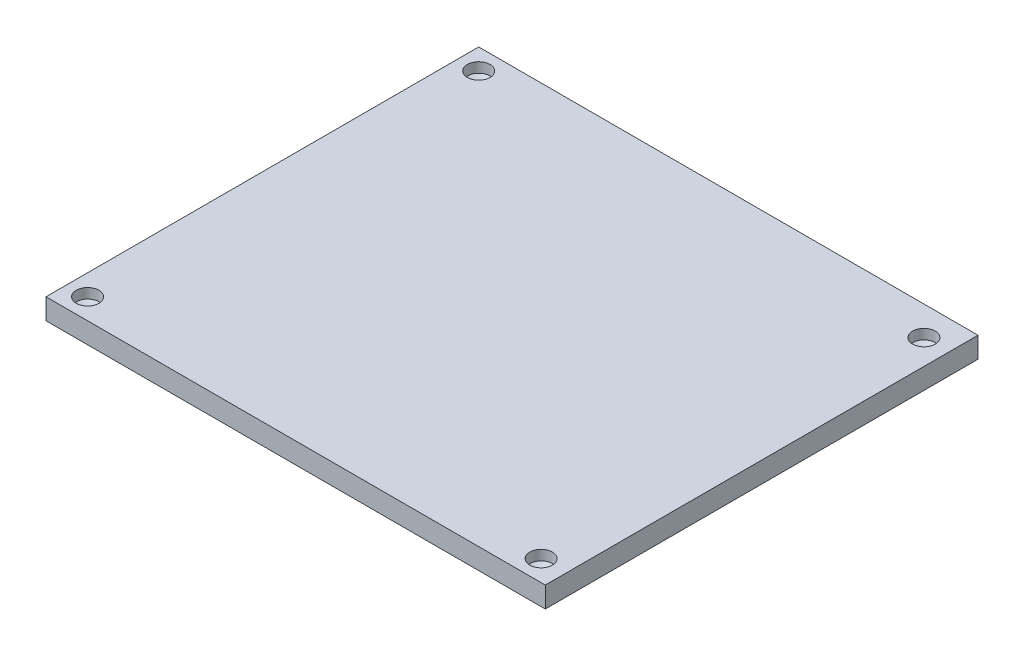
ISO-10303-21;
HEADER;
FILE_DESCRIPTION(('STEP AP214'),'2;1');
FILE_NAME('part.step','',(''),(''),'','','');
FILE_SCHEMA(('AUTOMOTIVE_DESIGN { 1 0 10303 214 1 1 1 1 }'));
ENDSEC;
DATA;
#1=APPLICATION_CONTEXT('core data for automotive mechanical design processes');
#2=APPLICATION_PROTOCOL_DEFINITION('international standard','automotive_design',2000,#1);
#3=PRODUCT_CONTEXT('',#1,'mechanical');
#4=PRODUCT('Part','Part','',(#3));
#5=PRODUCT_RELATED_PRODUCT_CATEGORY('part','',(#4));
#6=PRODUCT_DEFINITION_FORMATION('','',#4);
#7=PRODUCT_DEFINITION_CONTEXT('part definition',#1,'design');
#8=PRODUCT_DEFINITION('design','',#6,#7);
#9=PRODUCT_DEFINITION_SHAPE('','',#8);
#10=(LENGTH_UNIT() NAMED_UNIT(*) SI_UNIT(.MILLI.,.METRE.));
#11=(NAMED_UNIT(*) PLANE_ANGLE_UNIT() SI_UNIT($,.RADIAN.));
#12=(NAMED_UNIT(*) SI_UNIT($,.STERADIAN.) SOLID_ANGLE_UNIT());
#13=UNCERTAINTY_MEASURE_WITH_UNIT(LENGTH_MEASURE(1.E-05),#10,'distance_accuracy_value','');
#14=(GEOMETRIC_REPRESENTATION_CONTEXT(3) GLOBAL_UNCERTAINTY_ASSIGNED_CONTEXT((#13)) GLOBAL_UNIT_ASSIGNED_CONTEXT((#10,
#11,#12)) REPRESENTATION_CONTEXT('',''));
#15=CARTESIAN_POINT('',(0.,0.,0.));
#16=DIRECTION('',(0.,0.,1.));
#17=DIRECTION('',(1.,0.,0.));
#18=AXIS2_PLACEMENT_3D('',#15,#16,#17);
#19=CARTESIAN_POINT('',(-38.1,3.175,33.02));
#20=DIRECTION('',(0.,0.,-1.));
#21=DIRECTION('',(-1.,0.,0.));
#22=AXIS2_PLACEMENT_3D('',#19,#20,#21);
#23=PLANE('',#22);
#24=DIRECTION('',(1.,0.,0.));
#25=VECTOR('',#24,1.);
#26=CARTESIAN_POINT('',(-38.1,0.,33.02));
#27=LINE('',#26,#25);
#28=CARTESIAN_POINT('',(-38.1,0.,33.02));
#29=VERTEX_POINT('',#28);
#30=CARTESIAN_POINT('',(38.1,0.,33.02));
#31=VERTEX_POINT('',#30);
#32=EDGE_CURVE('E126',#29,#31,#27,.T.);
#33=ORIENTED_EDGE('',*,*,#32,.T.);
#34=DIRECTION('',(0.,-1.,0.));
#35=VECTOR('',#34,1.);
#36=CARTESIAN_POINT('',(38.1,3.175,33.02));
#37=LINE('',#36,#35);
#38=CARTESIAN_POINT('',(38.1,3.175,33.02));
#39=VERTEX_POINT('',#38);
#40=EDGE_CURVE('E11',#39,#31,#37,.T.);
#41=ORIENTED_EDGE('',*,*,#40,.F.);
#42=DIRECTION('',(1.,0.,0.));
#43=VECTOR('',#42,1.);
#44=CARTESIAN_POINT('',(-38.1,3.175,33.02));
#45=LINE('',#44,#43);
#46=CARTESIAN_POINT('',(-38.1,3.175,33.02));
#47=VERTEX_POINT('',#46);
#48=EDGE_CURVE('E119',#47,#39,#45,.T.);
#49=ORIENTED_EDGE('',*,*,#48,.F.);
#50=DIRECTION('',(0.,-1.,0.));
#51=VECTOR('',#50,1.);
#52=CARTESIAN_POINT('',(-38.1,3.175,33.02));
#53=LINE('',#52,#51);
#54=EDGE_CURVE('E125',#47,#29,#53,.T.);
#55=ORIENTED_EDGE('',*,*,#54,.T.);
#56=EDGE_LOOP('',(#33,#41,#49,#55));
#57=FACE_BOUND('',#56,.T.);
#58=ADVANCED_FACE('F33',(#57),#23,.F.);
#59=CARTESIAN_POINT('',(38.1,3.175,-33.02));
#60=DIRECTION('',(-1.,0.,0.));
#61=DIRECTION('',(0.,0.,1.));
#62=AXIS2_PLACEMENT_3D('',#59,#60,#61);
#63=PLANE('',#62);
#64=DIRECTION('',(0.,0.,-1.));
#65=VECTOR('',#64,1.);
#66=CARTESIAN_POINT('',(38.1,0.,-33.02));
#67=LINE('',#66,#65);
#68=CARTESIAN_POINT('',(38.1,0.,-33.02));
#69=VERTEX_POINT('',#68);
#70=EDGE_CURVE('E129',#31,#69,#67,.T.);
#71=ORIENTED_EDGE('',*,*,#70,.T.);
#72=DIRECTION('',(0.,-1.,0.));
#73=VECTOR('',#72,1.);
#74=CARTESIAN_POINT('',(38.1,3.175,-33.02));
#75=LINE('',#74,#73);
#76=CARTESIAN_POINT('',(38.1,3.175,-33.02));
#77=VERTEX_POINT('',#76);
#78=EDGE_CURVE('E42',#77,#69,#75,.T.);
#79=ORIENTED_EDGE('',*,*,#78,.F.);
#80=DIRECTION('',(0.,0.,-1.));
#81=VECTOR('',#80,1.);
#82=CARTESIAN_POINT('',(38.1,3.175,-33.02));
#83=LINE('',#82,#81);
#84=EDGE_CURVE('E82',#39,#77,#83,.T.);
#85=ORIENTED_EDGE('',*,*,#84,.F.);
#86=ORIENTED_EDGE('',*,*,#40,.T.);
#87=EDGE_LOOP('',(#71,#79,#85,#86));
#88=FACE_BOUND('',#87,.T.);
#89=ADVANCED_FACE('F163',(#88),#63,.F.);
#90=CARTESIAN_POINT('',(-38.1,3.175,-33.02));
#91=DIRECTION('',(0.,0.,1.));
#92=DIRECTION('',(1.,0.,0.));
#93=AXIS2_PLACEMENT_3D('',#90,#91,#92);
#94=PLANE('',#93);
#95=DIRECTION('',(-1.,0.,0.));
#96=VECTOR('',#95,1.);
#97=CARTESIAN_POINT('',(-38.1,0.,-33.02));
#98=LINE('',#97,#96);
#99=CARTESIAN_POINT('',(-38.1,0.,-33.02));
#100=VERTEX_POINT('',#99);
#101=EDGE_CURVE('E69',#69,#100,#98,.T.);
#102=ORIENTED_EDGE('',*,*,#101,.T.);
#103=DIRECTION('',(0.,-1.,0.));
#104=VECTOR('',#103,1.);
#105=CARTESIAN_POINT('',(-38.1,3.175,-33.02));
#106=LINE('',#105,#104);
#107=CARTESIAN_POINT('',(-38.1,3.175,-33.02));
#108=VERTEX_POINT('',#107);
#109=EDGE_CURVE('E134',#108,#100,#106,.T.);
#110=ORIENTED_EDGE('',*,*,#109,.F.);
#111=DIRECTION('',(-1.,0.,0.));
#112=VECTOR('',#111,1.);
#113=CARTESIAN_POINT('',(-38.1,3.175,-33.02));
#114=LINE('',#113,#112);
#115=EDGE_CURVE('E122',#77,#108,#114,.T.);
#116=ORIENTED_EDGE('',*,*,#115,.F.);
#117=ORIENTED_EDGE('',*,*,#78,.T.);
#118=EDGE_LOOP('',(#102,#110,#116,#117));
#119=FACE_BOUND('',#118,.T.);
#120=ADVANCED_FACE('F168',(#119),#94,.F.);
#121=CARTESIAN_POINT('',(-38.1,3.175,-33.02));
#122=DIRECTION('',(1.,0.,0.));
#123=DIRECTION('',(0.,0.,-1.));
#124=AXIS2_PLACEMENT_3D('',#121,#122,#123);
#125=PLANE('',#124);
#126=DIRECTION('',(0.,0.,1.));
#127=VECTOR('',#126,1.);
#128=CARTESIAN_POINT('',(-38.1,0.,-33.02));
#129=LINE('',#128,#127);
#130=EDGE_CURVE('E75',#100,#29,#129,.T.);
#131=ORIENTED_EDGE('',*,*,#130,.T.);
#132=ORIENTED_EDGE('',*,*,#54,.F.);
#133=DIRECTION('',(0.,0.,1.));
#134=VECTOR('',#133,1.);
#135=CARTESIAN_POINT('',(-38.1,3.175,-33.02));
#136=LINE('',#135,#134);
#137=EDGE_CURVE('E51',#108,#47,#136,.T.);
#138=ORIENTED_EDGE('',*,*,#137,.F.);
#139=ORIENTED_EDGE('',*,*,#109,.T.);
#140=EDGE_LOOP('',(#131,#132,#138,#139));
#141=FACE_BOUND('',#140,.T.);
#142=ADVANCED_FACE('F176',(#141),#125,.F.);
#143=CARTESIAN_POINT('',(0.,3.175,0.));
#144=DIRECTION('',(0.,-1.,0.));
#145=DIRECTION('',(0.,0.,-1.));
#146=AXIS2_PLACEMENT_3D('',#143,#144,#145);
#147=PLANE('',#146);
#148=CARTESIAN_POINT('',(-34.925,3.175,-29.845));
#149=DIRECTION('',(0.,-1.,0.));
#150=DIRECTION('',(0.,0.,-1.));
#151=AXIS2_PLACEMENT_3D('',#148,#149,#150);
#152=CIRCLE('',#151,1.7272);
#153=CARTESIAN_POINT('',(-34.925,3.175,-31.5722));
#154=VERTEX_POINT('',#153);
#155=EDGE_CURVE('E36',#154,#154,#152,.T.);
#156=ORIENTED_EDGE('',*,*,#155,.T.);
#157=EDGE_LOOP('',(#156));
#158=FACE_BOUND('',#157,.T.);
#159=CARTESIAN_POINT('',(34.29,3.175,-28.575));
#160=DIRECTION('',(0.,-1.,0.));
#161=DIRECTION('',(0.,0.,-1.));
#162=AXIS2_PLACEMENT_3D('',#159,#160,#161);
#163=CIRCLE('',#162,1.7272);
#164=CARTESIAN_POINT('',(34.29,3.175,-30.3022));
#165=VERTEX_POINT('',#164);
#166=EDGE_CURVE('E110',#165,#165,#163,.T.);
#167=ORIENTED_EDGE('',*,*,#166,.T.);
#168=EDGE_LOOP('',(#167));
#169=FACE_BOUND('',#168,.T.);
#170=CARTESIAN_POINT('',(34.29,3.175,29.845));
#171=DIRECTION('',(0.,-1.,0.));
#172=DIRECTION('',(0.,0.,-1.));
#173=AXIS2_PLACEMENT_3D('',#170,#171,#172);
#174=CIRCLE('',#173,1.7272);
#175=CARTESIAN_POINT('',(34.29,3.175,28.1178));
#176=VERTEX_POINT('',#175);
#177=EDGE_CURVE('E114',#176,#176,#174,.T.);
#178=ORIENTED_EDGE('',*,*,#177,.T.);
#179=EDGE_LOOP('',(#178));
#180=FACE_BOUND('',#179,.T.);
#181=CARTESIAN_POINT('',(-34.925,3.175,29.845));
#182=DIRECTION('',(0.,-1.,0.));
#183=DIRECTION('',(0.,0.,-1.));
#184=AXIS2_PLACEMENT_3D('',#181,#182,#183);
#185=CIRCLE('',#184,1.7272);
#186=CARTESIAN_POINT('',(-34.925,3.175,28.1178));
#187=VERTEX_POINT('',#186);
#188=EDGE_CURVE('E118',#187,#187,#185,.T.);
#189=ORIENTED_EDGE('',*,*,#188,.T.);
#190=EDGE_LOOP('',(#189));
#191=FACE_BOUND('',#190,.T.);
#192=ORIENTED_EDGE('',*,*,#48,.T.);
#193=ORIENTED_EDGE('',*,*,#84,.T.);
#194=ORIENTED_EDGE('',*,*,#115,.T.);
#195=ORIENTED_EDGE('',*,*,#137,.T.);
#196=EDGE_LOOP('',(#192,#193,#194,#195));
#197=FACE_BOUND('',#196,.T.);
#198=ADVANCED_FACE('F143',(#158,#169,#180,#191,#197),#147,.F.);
#199=CARTESIAN_POINT('',(0.,0.,0.));
#200=DIRECTION('',(0.,-1.,0.));
#201=DIRECTION('',(0.,0.,-1.));
#202=AXIS2_PLACEMENT_3D('',#199,#200,#201);
#203=PLANE('',#202);
#204=ORIENTED_EDGE('',*,*,#32,.F.);
#205=ORIENTED_EDGE('',*,*,#130,.F.);
#206=ORIENTED_EDGE('',*,*,#101,.F.);
#207=ORIENTED_EDGE('',*,*,#70,.F.);
#208=EDGE_LOOP('',(#204,#205,#206,#207));
#209=FACE_BOUND('',#208,.T.);
#210=ADVANCED_FACE('F173',(#209),#203,.T.);
#211=CARTESIAN_POINT('',(-34.925,11.811,29.845));
#212=DIRECTION('',(0.,1.,0.));
#213=DIRECTION('',(0.,0.,1.));
#214=AXIS2_PLACEMENT_3D('',#211,#212,#213);
#215=CYLINDRICAL_SURFACE('',#214,1.7272);
#216=CARTESIAN_POINT('',(-34.925,1.651,29.845));
#217=DIRECTION('',(0.,1.,0.));
#218=DIRECTION('',(0.,0.,1.));
#219=AXIS2_PLACEMENT_3D('',#216,#217,#218);
#220=CIRCLE('',#219,1.7272);
#221=CARTESIAN_POINT('',(-34.925,1.651,31.5722));
#222=VERTEX_POINT('',#221);
#223=EDGE_CURVE('E115',#222,#222,#220,.T.);
#224=ORIENTED_EDGE('',*,*,#223,.F.);
#225=EDGE_LOOP('',(#224));
#226=FACE_BOUND('',#225,.T.);
#227=ORIENTED_EDGE('',*,*,#188,.F.);
#228=EDGE_LOOP('',(#227));
#229=FACE_BOUND('',#228,.T.);
#230=ADVANCED_FACE('F183',(#226,#229),#215,.F.);
#231=CARTESIAN_POINT('',(-34.925,1.651,29.845));
#232=DIRECTION('',(0.,1.,0.));
#233=DIRECTION('',(0.,0.,1.));
#234=AXIS2_PLACEMENT_3D('',#231,#232,#233);
#235=CONICAL_SURFACE('',#234,1.7272,1.02974425867665);
#236=CARTESIAN_POINT('',(-34.925,0.613193538815596,29.845));
#237=VERTEX_POINT('',#236);
#238=VERTEX_LOOP('',#237);
#239=FACE_BOUND('',#238,.T.);
#240=ORIENTED_EDGE('',*,*,#223,.T.);
#241=EDGE_LOOP('',(#240));
#242=FACE_BOUND('',#241,.T.);
#243=ADVANCED_FACE('F187',(#239,#242),#235,.F.);
#244=CARTESIAN_POINT('',(34.29,11.811,29.845));
#245=DIRECTION('',(0.,1.,0.));
#246=DIRECTION('',(0.,0.,1.));
#247=AXIS2_PLACEMENT_3D('',#244,#245,#246);
#248=CYLINDRICAL_SURFACE('',#247,1.7272);
#249=CARTESIAN_POINT('',(34.29,1.651,29.845));
#250=DIRECTION('',(0.,1.,0.));
#251=DIRECTION('',(0.,0.,1.));
#252=AXIS2_PLACEMENT_3D('',#249,#250,#251);
#253=CIRCLE('',#252,1.7272);
#254=CARTESIAN_POINT('',(34.29,1.651,31.5722));
#255=VERTEX_POINT('',#254);
#256=EDGE_CURVE('E111',#255,#255,#253,.T.);
#257=ORIENTED_EDGE('',*,*,#256,.F.);
#258=EDGE_LOOP('',(#257));
#259=FACE_BOUND('',#258,.T.);
#260=ORIENTED_EDGE('',*,*,#177,.F.);
#261=EDGE_LOOP('',(#260));
#262=FACE_BOUND('',#261,.T.);
#263=ADVANCED_FACE('F158',(#259,#262),#248,.F.);
#264=CARTESIAN_POINT('',(34.29,1.651,29.845));
#265=DIRECTION('',(0.,1.,0.));
#266=DIRECTION('',(0.,0.,1.));
#267=AXIS2_PLACEMENT_3D('',#264,#265,#266);
#268=CONICAL_SURFACE('',#267,1.7272,1.02974425867665);
#269=CARTESIAN_POINT('',(34.29,0.613193538815596,29.845));
#270=VERTEX_POINT('',#269);
#271=VERTEX_LOOP('',#270);
#272=FACE_BOUND('',#271,.T.);
#273=ORIENTED_EDGE('',*,*,#256,.T.);
#274=EDGE_LOOP('',(#273));
#275=FACE_BOUND('',#274,.T.);
#276=ADVANCED_FACE('F149',(#272,#275),#268,.F.);
#277=CARTESIAN_POINT('',(34.29,11.811,-28.575));
#278=DIRECTION('',(0.,1.,0.));
#279=DIRECTION('',(0.,0.,1.));
#280=AXIS2_PLACEMENT_3D('',#277,#278,#279);
#281=CYLINDRICAL_SURFACE('',#280,1.7272);
#282=CARTESIAN_POINT('',(34.29,1.651,-28.575));
#283=DIRECTION('',(0.,1.,0.));
#284=DIRECTION('',(0.,0.,1.));
#285=AXIS2_PLACEMENT_3D('',#282,#283,#284);
#286=CIRCLE('',#285,1.7272);
#287=CARTESIAN_POINT('',(34.29,1.651,-26.8478));
#288=VERTEX_POINT('',#287);
#289=EDGE_CURVE('E106',#288,#288,#286,.T.);
#290=ORIENTED_EDGE('',*,*,#289,.F.);
#291=EDGE_LOOP('',(#290));
#292=FACE_BOUND('',#291,.T.);
#293=ORIENTED_EDGE('',*,*,#166,.F.);
#294=EDGE_LOOP('',(#293));
#295=FACE_BOUND('',#294,.T.);
#296=ADVANCED_FACE('F146',(#292,#295),#281,.F.);
#297=CARTESIAN_POINT('',(34.29,1.651,-28.575));
#298=DIRECTION('',(0.,1.,0.));
#299=DIRECTION('',(0.,0.,1.));
#300=AXIS2_PLACEMENT_3D('',#297,#298,#299);
#301=CONICAL_SURFACE('',#300,1.7272,1.02974425867665);
#302=CARTESIAN_POINT('',(34.29,0.613193538815596,-28.575));
#303=VERTEX_POINT('',#302);
#304=VERTEX_LOOP('',#303);
#305=FACE_BOUND('',#304,.T.);
#306=ORIENTED_EDGE('',*,*,#289,.T.);
#307=EDGE_LOOP('',(#306));
#308=FACE_BOUND('',#307,.T.);
#309=ADVANCED_FACE('F148',(#305,#308),#301,.F.);
#310=CARTESIAN_POINT('',(-34.925,11.811,-29.845));
#311=DIRECTION('',(0.,1.,0.));
#312=DIRECTION('',(0.,0.,1.));
#313=AXIS2_PLACEMENT_3D('',#310,#311,#312);
#314=CYLINDRICAL_SURFACE('',#313,1.7272);
#315=CARTESIAN_POINT('',(-34.925,1.651,-29.845));
#316=DIRECTION('',(0.,1.,0.));
#317=DIRECTION('',(0.,0.,1.));
#318=AXIS2_PLACEMENT_3D('',#315,#316,#317);
#319=CIRCLE('',#318,1.7272);
#320=CARTESIAN_POINT('',(-34.925,1.651,-28.1178));
#321=VERTEX_POINT('',#320);
#322=EDGE_CURVE('E102',#321,#321,#319,.T.);
#323=ORIENTED_EDGE('',*,*,#322,.F.);
#324=EDGE_LOOP('',(#323));
#325=FACE_BOUND('',#324,.T.);
#326=ORIENTED_EDGE('',*,*,#155,.F.);
#327=EDGE_LOOP('',(#326));
#328=FACE_BOUND('',#327,.T.);
#329=ADVANCED_FACE('F98',(#325,#328),#314,.F.);
#330=CARTESIAN_POINT('',(-34.925,1.651,-29.845));
#331=DIRECTION('',(0.,1.,0.));
#332=DIRECTION('',(0.,0.,1.));
#333=AXIS2_PLACEMENT_3D('',#330,#331,#332);
#334=CONICAL_SURFACE('',#333,1.7272,1.02974425867665);
#335=CARTESIAN_POINT('',(-34.925,0.613193538815596,-29.845));
#336=VERTEX_POINT('',#335);
#337=VERTEX_LOOP('',#336);
#338=FACE_BOUND('',#337,.T.);
#339=ORIENTED_EDGE('',*,*,#322,.T.);
#340=EDGE_LOOP('',(#339));
#341=FACE_BOUND('',#340,.T.);
#342=ADVANCED_FACE('F95',(#338,#341),#334,.F.);
#343=CLOSED_SHELL('',(#58,#89,#120,#142,#198,#210,#230,#243,#263,#276,#296,#309,#329,#342));
#344=MANIFOLD_SOLID_BREP('B2',#343);
#345=ADVANCED_BREP_SHAPE_REPRESENTATION('',(#18,#344),#14);
#346=SHAPE_DEFINITION_REPRESENTATION(#9,#345);
ENDSEC;
END-ISO-10303-21;
